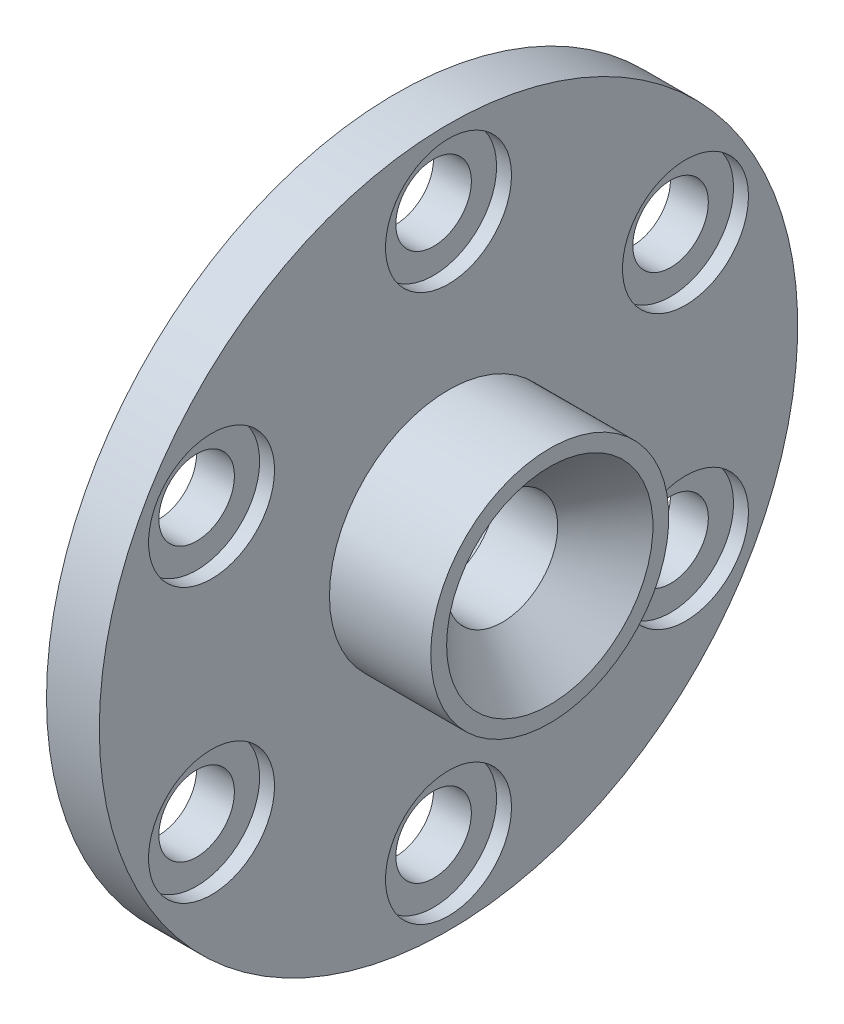
ISO-10303-21;
HEADER;
FILE_DESCRIPTION(('STEP AP214'),'2;1');
FILE_NAME('part.step','',(''),(''),'','','');
FILE_SCHEMA(('AUTOMOTIVE_DESIGN { 1 0 10303 214 1 1 1 1 }'));
ENDSEC;
DATA;
#1=APPLICATION_CONTEXT('core data for automotive mechanical design processes');
#2=APPLICATION_PROTOCOL_DEFINITION('international standard','automotive_design',2000,#1);
#3=PRODUCT_CONTEXT('',#1,'mechanical');
#4=PRODUCT('Part','Part','',(#3));
#5=PRODUCT_RELATED_PRODUCT_CATEGORY('part','',(#4));
#6=PRODUCT_DEFINITION_FORMATION('','',#4);
#7=PRODUCT_DEFINITION_CONTEXT('part definition',#1,'design');
#8=PRODUCT_DEFINITION('design','',#6,#7);
#9=PRODUCT_DEFINITION_SHAPE('','',#8);
#10=(LENGTH_UNIT() NAMED_UNIT(*) SI_UNIT(.MILLI.,.METRE.));
#11=(NAMED_UNIT(*) PLANE_ANGLE_UNIT() SI_UNIT($,.RADIAN.));
#12=(NAMED_UNIT(*) SI_UNIT($,.STERADIAN.) SOLID_ANGLE_UNIT());
#13=UNCERTAINTY_MEASURE_WITH_UNIT(LENGTH_MEASURE(1.E-05),#10,'distance_accuracy_value','');
#14=(GEOMETRIC_REPRESENTATION_CONTEXT(3) GLOBAL_UNCERTAINTY_ASSIGNED_CONTEXT((#13)) GLOBAL_UNIT_ASSIGNED_CONTEXT((#10,
#11,#12)) REPRESENTATION_CONTEXT('',''));
#15=CARTESIAN_POINT('',(0.,0.,0.));
#16=DIRECTION('',(0.,0.,1.));
#17=DIRECTION('',(1.,0.,0.));
#18=AXIS2_PLACEMENT_3D('',#15,#16,#17);
#19=CARTESIAN_POINT('',(23.019799782,8.61924996999999,14.9289788711765));
#20=DIRECTION('',(-1.,0.,0.));
#21=DIRECTION('',(0.,0.,1.));
#22=AXIS2_PLACEMENT_3D('',#19,#20,#21);
#23=CYLINDRICAL_SURFACE('',#22,2.38125);
#24=CARTESIAN_POINT('',(13.312399842,8.61924996999999,14.9289788711765));
#25=DIRECTION('',(1.,0.,0.));
#26=DIRECTION('',(0.,0.,-1.));
#27=AXIS2_PLACEMENT_3D('',#24,#25,#26);
#28=CIRCLE('',#27,2.38125);
#29=CARTESIAN_POINT('',(13.312399842,8.61924996999999,12.5477288711765));
#30=VERTEX_POINT('',#29);
#31=EDGE_CURVE('E69',#30,#30,#28,.F.);
#32=ORIENTED_EDGE('',*,*,#31,.T.);
#33=EDGE_LOOP('',(#32));
#34=FACE_BOUND('',#33,.T.);
#35=CARTESIAN_POINT('',(15.699999842,8.61924996999999,14.9289788711765));
#36=DIRECTION('',(1.,0.,0.));
#37=DIRECTION('',(0.,0.,-1.));
#38=AXIS2_PLACEMENT_3D('',#35,#36,#37);
#39=CIRCLE('',#38,2.38125);
#40=CARTESIAN_POINT('',(15.699999842,8.61924996999999,12.5477288711765));
#41=VERTEX_POINT('',#40);
#42=EDGE_CURVE('E39',#41,#41,#39,.T.);
#43=ORIENTED_EDGE('',*,*,#42,.T.);
#44=EDGE_LOOP('',(#43));
#45=FACE_BOUND('',#44,.T.);
#46=ADVANCED_FACE('F35',(#34,#45),#23,.F.);
#47=CARTESIAN_POINT('',(23.019799782,17.23849994,0.));
#48=DIRECTION('',(-1.,0.,0.));
#49=DIRECTION('',(0.,0.,1.));
#50=AXIS2_PLACEMENT_3D('',#47,#48,#49);
#51=CYLINDRICAL_SURFACE('',#50,2.38125);
#52=CARTESIAN_POINT('',(13.312399842,17.23849994,0.));
#53=DIRECTION('',(1.,0.,0.));
#54=DIRECTION('',(0.,0.,-1.));
#55=AXIS2_PLACEMENT_3D('',#52,#53,#54);
#56=CIRCLE('',#55,2.38125);
#57=CARTESIAN_POINT('',(13.312399842,17.23849994,-2.38125));
#58=VERTEX_POINT('',#57);
#59=EDGE_CURVE('E73',#58,#58,#56,.F.);
#60=ORIENTED_EDGE('',*,*,#59,.T.);
#61=EDGE_LOOP('',(#60));
#62=FACE_BOUND('',#61,.T.);
#63=CARTESIAN_POINT('',(15.699999842,17.23849994,0.));
#64=DIRECTION('',(1.,0.,0.));
#65=DIRECTION('',(0.,0.,-1.));
#66=AXIS2_PLACEMENT_3D('',#63,#64,#65);
#67=CIRCLE('',#66,2.38125);
#68=CARTESIAN_POINT('',(15.699999842,17.23849994,-2.38125));
#69=VERTEX_POINT('',#68);
#70=EDGE_CURVE('E64',#69,#69,#67,.T.);
#71=ORIENTED_EDGE('',*,*,#70,.T.);
#72=EDGE_LOOP('',(#71));
#73=FACE_BOUND('',#72,.T.);
#74=ADVANCED_FACE('F187',(#62,#73),#51,.F.);
#75=CARTESIAN_POINT('',(23.019799782,8.61924997,-14.9289788711765));
#76=DIRECTION('',(-1.,0.,0.));
#77=DIRECTION('',(0.,0.,1.));
#78=AXIS2_PLACEMENT_3D('',#75,#76,#77);
#79=CYLINDRICAL_SURFACE('',#78,2.38125);
#80=CARTESIAN_POINT('',(13.312399842,8.61924997,-14.9289788711765));
#81=DIRECTION('',(1.,0.,0.));
#82=DIRECTION('',(0.,0.,-1.));
#83=AXIS2_PLACEMENT_3D('',#80,#81,#82);
#84=CIRCLE('',#83,2.38125);
#85=CARTESIAN_POINT('',(13.312399842,8.61924997,-17.3102288711765));
#86=VERTEX_POINT('',#85);
#87=EDGE_CURVE('E78',#86,#86,#84,.F.);
#88=ORIENTED_EDGE('',*,*,#87,.T.);
#89=EDGE_LOOP('',(#88));
#90=FACE_BOUND('',#89,.T.);
#91=CARTESIAN_POINT('',(15.699999842,8.61924997,-14.9289788711765));
#92=DIRECTION('',(1.,0.,0.));
#93=DIRECTION('',(0.,0.,-1.));
#94=AXIS2_PLACEMENT_3D('',#91,#92,#93);
#95=CIRCLE('',#94,2.38125);
#96=CARTESIAN_POINT('',(15.699999842,8.61924997,-17.3102288711765));
#97=VERTEX_POINT('',#96);
#98=EDGE_CURVE('E62',#97,#97,#95,.T.);
#99=ORIENTED_EDGE('',*,*,#98,.T.);
#100=EDGE_LOOP('',(#99));
#101=FACE_BOUND('',#100,.T.);
#102=ADVANCED_FACE('F192',(#90,#101),#79,.F.);
#103=CARTESIAN_POINT('',(23.019799782,-8.61924997,-14.9289788711765));
#104=DIRECTION('',(-1.,0.,0.));
#105=DIRECTION('',(0.,0.,1.));
#106=AXIS2_PLACEMENT_3D('',#103,#104,#105);
#107=CYLINDRICAL_SURFACE('',#106,2.38125);
#108=CARTESIAN_POINT('',(13.312399842,-8.61924997,-14.9289788711765));
#109=DIRECTION('',(1.,0.,0.));
#110=DIRECTION('',(0.,0.,-1.));
#111=AXIS2_PLACEMENT_3D('',#108,#109,#110);
#112=CIRCLE('',#111,2.38125);
#113=CARTESIAN_POINT('',(13.312399842,-8.61924997,-17.3102288711765));
#114=VERTEX_POINT('',#113);
#115=EDGE_CURVE('E86',#114,#114,#112,.F.);
#116=ORIENTED_EDGE('',*,*,#115,.T.);
#117=EDGE_LOOP('',(#116));
#118=FACE_BOUND('',#117,.T.);
#119=CARTESIAN_POINT('',(15.699999842,-8.61924997,-14.9289788711765));
#120=DIRECTION('',(1.,0.,0.));
#121=DIRECTION('',(0.,0.,-1.));
#122=AXIS2_PLACEMENT_3D('',#119,#120,#121);
#123=CIRCLE('',#122,2.38125);
#124=CARTESIAN_POINT('',(15.699999842,-8.61924997,-17.3102288711765));
#125=VERTEX_POINT('',#124);
#126=EDGE_CURVE('E59',#125,#125,#123,.T.);
#127=ORIENTED_EDGE('',*,*,#126,.T.);
#128=EDGE_LOOP('',(#127));
#129=FACE_BOUND('',#128,.T.);
#130=ADVANCED_FACE('F307',(#118,#129),#107,.F.);
#131=CARTESIAN_POINT('',(23.019799782,-17.23849994,0.));
#132=DIRECTION('',(-1.,0.,0.));
#133=DIRECTION('',(0.,0.,1.));
#134=AXIS2_PLACEMENT_3D('',#131,#132,#133);
#135=CYLINDRICAL_SURFACE('',#134,2.38125);
#136=CARTESIAN_POINT('',(13.312399842,-17.23849994,0.));
#137=DIRECTION('',(1.,0.,0.));
#138=DIRECTION('',(0.,0.,-1.));
#139=AXIS2_PLACEMENT_3D('',#136,#137,#138);
#140=CIRCLE('',#139,2.38125);
#141=CARTESIAN_POINT('',(13.312399842,-17.23849994,-2.38125));
#142=VERTEX_POINT('',#141);
#143=EDGE_CURVE('E89',#142,#142,#140,.F.);
#144=ORIENTED_EDGE('',*,*,#143,.T.);
#145=EDGE_LOOP('',(#144));
#146=FACE_BOUND('',#145,.T.);
#147=CARTESIAN_POINT('',(15.699999842,-17.23849994,0.));
#148=DIRECTION('',(1.,0.,0.));
#149=DIRECTION('',(0.,0.,-1.));
#150=AXIS2_PLACEMENT_3D('',#147,#148,#149);
#151=CIRCLE('',#150,2.38125);
#152=CARTESIAN_POINT('',(15.699999842,-17.23849994,-2.38125));
#153=VERTEX_POINT('',#152);
#154=EDGE_CURVE('E55',#153,#153,#151,.T.);
#155=ORIENTED_EDGE('',*,*,#154,.T.);
#156=EDGE_LOOP('',(#155));
#157=FACE_BOUND('',#156,.T.);
#158=ADVANCED_FACE('F181',(#146,#157),#135,.F.);
#159=CARTESIAN_POINT('',(23.019799782,-8.61924997000001,14.9289788711765));
#160=DIRECTION('',(-1.,0.,0.));
#161=DIRECTION('',(0.,0.,1.));
#162=AXIS2_PLACEMENT_3D('',#159,#160,#161);
#163=CYLINDRICAL_SURFACE('',#162,2.38125);
#164=CARTESIAN_POINT('',(13.312399842,-8.61924997000001,14.9289788711765));
#165=DIRECTION('',(1.,0.,0.));
#166=DIRECTION('',(0.,0.,-1.));
#167=AXIS2_PLACEMENT_3D('',#164,#165,#166);
#168=CIRCLE('',#167,2.38125);
#169=CARTESIAN_POINT('',(13.312399842,-8.61924997000001,12.5477288711765));
#170=VERTEX_POINT('',#169);
#171=EDGE_CURVE('E92',#170,#170,#168,.F.);
#172=ORIENTED_EDGE('',*,*,#171,.T.);
#173=EDGE_LOOP('',(#172));
#174=FACE_BOUND('',#173,.T.);
#175=CARTESIAN_POINT('',(15.699999842,-8.61924997000001,14.9289788711765));
#176=DIRECTION('',(1.,0.,0.));
#177=DIRECTION('',(0.,0.,-1.));
#178=AXIS2_PLACEMENT_3D('',#175,#176,#177);
#179=CIRCLE('',#178,2.38125);
#180=CARTESIAN_POINT('',(15.699999842,-8.61924997000001,12.5477288711765));
#181=VERTEX_POINT('',#180);
#182=EDGE_CURVE('E52',#181,#181,#179,.T.);
#183=ORIENTED_EDGE('',*,*,#182,.T.);
#184=EDGE_LOOP('',(#183));
#185=FACE_BOUND('',#184,.T.);
#186=ADVANCED_FACE('F174',(#174,#185),#163,.F.);
#187=CARTESIAN_POINT('',(13.312399842,12.269749908,0.));
#188=DIRECTION('',(1.,0.,0.));
#189=DIRECTION('',(0.,0.,-1.));
#190=AXIS2_PLACEMENT_3D('',#187,#188,#189);
#191=PLANE('',#190);
#192=ORIENTED_EDGE('',*,*,#171,.F.);
#193=EDGE_LOOP('',(#192));
#194=FACE_BOUND('',#193,.T.);
#195=ORIENTED_EDGE('',*,*,#143,.F.);
#196=EDGE_LOOP('',(#195));
#197=FACE_BOUND('',#196,.T.);
#198=ORIENTED_EDGE('',*,*,#115,.F.);
#199=EDGE_LOOP('',(#198));
#200=FACE_BOUND('',#199,.T.);
#201=ORIENTED_EDGE('',*,*,#87,.F.);
#202=EDGE_LOOP('',(#201));
#203=FACE_BOUND('',#202,.T.);
#204=ORIENTED_EDGE('',*,*,#59,.F.);
#205=EDGE_LOOP('',(#204));
#206=FACE_BOUND('',#205,.T.);
#207=ORIENTED_EDGE('',*,*,#31,.F.);
#208=EDGE_LOOP('',(#207));
#209=FACE_BOUND('',#208,.T.);
#210=CARTESIAN_POINT('',(13.312399842,0.,0.));
#211=DIRECTION('',(-1.,0.,0.));
#212=DIRECTION('',(0.,0.,1.));
#213=AXIS2_PLACEMENT_3D('',#210,#211,#212);
#214=CIRCLE('',#213,12.269749908);
#215=CARTESIAN_POINT('',(13.312399842,0.,12.269749908));
#216=VERTEX_POINT('',#215);
#217=EDGE_CURVE('E95',#216,#216,#214,.T.);
#218=ORIENTED_EDGE('',*,*,#217,.F.);
#219=EDGE_LOOP('',(#218));
#220=FACE_BOUND('',#219,.T.);
#221=CARTESIAN_POINT('',(13.312399842,0.,0.));
#222=DIRECTION('',(-1.,0.,0.));
#223=DIRECTION('',(0.,0.,1.));
#224=AXIS2_PLACEMENT_3D('',#221,#222,#223);
#225=CIRCLE('',#224,22.00099994);
#226=CARTESIAN_POINT('',(13.312399842,0.,22.00099994));
#227=VERTEX_POINT('',#226);
#228=EDGE_CURVE('E10',#227,#227,#225,.T.);
#229=ORIENTED_EDGE('',*,*,#228,.T.);
#230=EDGE_LOOP('',(#229));
#231=FACE_BOUND('',#230,.T.);
#232=ADVANCED_FACE('F37',(#194,#197,#200,#203,#206,#209,#220,#231),#191,.F.);
#233=CARTESIAN_POINT('',(0.,0.,0.));
#234=DIRECTION('',(-1.,0.,0.));
#235=DIRECTION('',(0.,0.,1.));
#236=AXIS2_PLACEMENT_3D('',#233,#234,#235);
#237=CYLINDRICAL_SURFACE('',#236,22.00099994);
#238=ORIENTED_EDGE('',*,*,#228,.F.);
#239=EDGE_LOOP('',(#238));
#240=FACE_BOUND('',#239,.T.);
#241=CARTESIAN_POINT('',(16.639799842,0.,0.));
#242=DIRECTION('',(-1.,0.,0.));
#243=DIRECTION('',(0.,0.,1.));
#244=AXIS2_PLACEMENT_3D('',#241,#242,#243);
#245=CIRCLE('',#244,22.00099994);
#246=CARTESIAN_POINT('',(16.639799842,0.,22.00099994));
#247=VERTEX_POINT('',#246);
#248=EDGE_CURVE('E43',#247,#247,#245,.T.);
#249=ORIENTED_EDGE('',*,*,#248,.T.);
#250=EDGE_LOOP('',(#249));
#251=FACE_BOUND('',#250,.T.);
#252=ADVANCED_FACE('F173',(#240,#251),#237,.T.);
#253=CARTESIAN_POINT('',(16.639799842,22.00099994,0.));
#254=DIRECTION('',(-1.,0.,0.));
#255=DIRECTION('',(0.,0.,1.));
#256=AXIS2_PLACEMENT_3D('',#253,#254,#255);
#257=PLANE('',#256);
#258=CARTESIAN_POINT('',(16.639799842,17.23849994,0.));
#259=DIRECTION('',(1.,0.,0.));
#260=DIRECTION('',(0.,0.,-1.));
#261=AXIS2_PLACEMENT_3D('',#258,#259,#260);
#262=CIRCLE('',#261,3.96875);
#263=CARTESIAN_POINT('',(16.639799842,17.23849994,-3.96875));
#264=VERTEX_POINT('',#263);
#265=EDGE_CURVE('E204',#264,#264,#262,.T.);
#266=ORIENTED_EDGE('',*,*,#265,.F.);
#267=EDGE_LOOP('',(#266));
#268=FACE_BOUND('',#267,.T.);
#269=CARTESIAN_POINT('',(16.639799842,8.61924996999999,14.9289788711765));
#270=DIRECTION('',(1.,0.,0.));
#271=DIRECTION('',(0.,0.,-1.));
#272=AXIS2_PLACEMENT_3D('',#269,#270,#271);
#273=CIRCLE('',#272,3.96875);
#274=CARTESIAN_POINT('',(16.639799842,8.61924996999999,10.9602288711765));
#275=VERTEX_POINT('',#274);
#276=EDGE_CURVE('E208',#275,#275,#273,.T.);
#277=ORIENTED_EDGE('',*,*,#276,.F.);
#278=EDGE_LOOP('',(#277));
#279=FACE_BOUND('',#278,.T.);
#280=CARTESIAN_POINT('',(16.639799842,-8.61924997000001,14.9289788711765));
#281=DIRECTION('',(1.,0.,0.));
#282=DIRECTION('',(0.,0.,-1.));
#283=AXIS2_PLACEMENT_3D('',#280,#281,#282);
#284=CIRCLE('',#283,3.96875);
#285=CARTESIAN_POINT('',(16.639799842,-8.61924997000001,10.9602288711765));
#286=VERTEX_POINT('',#285);
#287=EDGE_CURVE('E212',#286,#286,#284,.T.);
#288=ORIENTED_EDGE('',*,*,#287,.F.);
#289=EDGE_LOOP('',(#288));
#290=FACE_BOUND('',#289,.T.);
#291=CARTESIAN_POINT('',(16.639799842,-17.23849994,0.));
#292=DIRECTION('',(1.,0.,0.));
#293=DIRECTION('',(0.,0.,-1.));
#294=AXIS2_PLACEMENT_3D('',#291,#292,#293);
#295=CIRCLE('',#294,3.96875);
#296=CARTESIAN_POINT('',(16.639799842,-17.23849994,-3.96875));
#297=VERTEX_POINT('',#296);
#298=EDGE_CURVE('E216',#297,#297,#295,.T.);
#299=ORIENTED_EDGE('',*,*,#298,.F.);
#300=EDGE_LOOP('',(#299));
#301=FACE_BOUND('',#300,.T.);
#302=CARTESIAN_POINT('',(16.639799842,-8.61924997,-14.9289788711765));
#303=DIRECTION('',(1.,0.,0.));
#304=DIRECTION('',(0.,0.,-1.));
#305=AXIS2_PLACEMENT_3D('',#302,#303,#304);
#306=CIRCLE('',#305,3.96875);
#307=CARTESIAN_POINT('',(16.639799842,-8.61924997,-18.8977288711765));
#308=VERTEX_POINT('',#307);
#309=EDGE_CURVE('E220',#308,#308,#306,.T.);
#310=ORIENTED_EDGE('',*,*,#309,.F.);
#311=EDGE_LOOP('',(#310));
#312=FACE_BOUND('',#311,.T.);
#313=CARTESIAN_POINT('',(16.639799842,8.61924997,-14.9289788711765));
#314=DIRECTION('',(1.,0.,0.));
#315=DIRECTION('',(0.,0.,-1.));
#316=AXIS2_PLACEMENT_3D('',#313,#314,#315);
#317=CIRCLE('',#316,3.96875);
#318=CARTESIAN_POINT('',(16.639799842,8.61924997,-18.8977288711765));
#319=VERTEX_POINT('',#318);
#320=EDGE_CURVE('E224',#319,#319,#317,.T.);
#321=ORIENTED_EDGE('',*,*,#320,.F.);
#322=EDGE_LOOP('',(#321));
#323=FACE_BOUND('',#322,.T.);
#324=ORIENTED_EDGE('',*,*,#248,.F.);
#325=EDGE_LOOP('',(#324));
#326=FACE_BOUND('',#325,.T.);
#327=CARTESIAN_POINT('',(16.639799842,0.,0.));
#328=DIRECTION('',(-1.,0.,0.));
#329=DIRECTION('',(0.,0.,1.));
#330=AXIS2_PLACEMENT_3D('',#327,#328,#329);
#331=CIRCLE('',#330,7.499999986);
#332=CARTESIAN_POINT('',(16.639799842,0.,7.499999986));
#333=VERTEX_POINT('',#332);
#334=EDGE_CURVE('E48',#333,#333,#331,.T.);
#335=ORIENTED_EDGE('',*,*,#334,.T.);
#336=EDGE_LOOP('',(#335));
#337=FACE_BOUND('',#336,.T.);
#338=ADVANCED_FACE('F121',(#268,#279,#290,#301,#312,#323,#326,#337),#257,.F.);
#339=CARTESIAN_POINT('',(0.,0.,0.));
#340=DIRECTION('',(-1.,0.,0.));
#341=DIRECTION('',(0.,0.,1.));
#342=AXIS2_PLACEMENT_3D('',#339,#340,#341);
#343=CYLINDRICAL_SURFACE('',#342,7.499999986);
#344=ORIENTED_EDGE('',*,*,#334,.F.);
#345=EDGE_LOOP('',(#344));
#346=FACE_BOUND('',#345,.T.);
#347=CARTESIAN_POINT('',(23.019799782,0.,0.));
#348=DIRECTION('',(-1.,0.,0.));
#349=DIRECTION('',(0.,0.,1.));
#350=AXIS2_PLACEMENT_3D('',#347,#348,#349);
#351=CIRCLE('',#350,7.499999986);
#352=CARTESIAN_POINT('',(23.019799782,0.,7.499999986));
#353=VERTEX_POINT('',#352);
#354=EDGE_CURVE('E116',#353,#353,#351,.T.);
#355=ORIENTED_EDGE('',*,*,#354,.T.);
#356=EDGE_LOOP('',(#355));
#357=FACE_BOUND('',#356,.T.);
#358=ADVANCED_FACE('F123',(#346,#357),#343,.T.);
#359=CARTESIAN_POINT('',(23.019799782,7.499999986,0.));
#360=DIRECTION('',(-1.,0.,0.));
#361=DIRECTION('',(0.,0.,1.));
#362=AXIS2_PLACEMENT_3D('',#359,#360,#361);
#363=PLANE('',#362);
#364=ORIENTED_EDGE('',*,*,#354,.F.);
#365=EDGE_LOOP('',(#364));
#366=FACE_BOUND('',#365,.T.);
#367=CARTESIAN_POINT('',(23.019799782,0.,0.));
#368=DIRECTION('',(-1.,0.,0.));
#369=DIRECTION('',(0.,0.,1.));
#370=AXIS2_PLACEMENT_3D('',#367,#368,#369);
#371=CIRCLE('',#370,6.499999954);
#372=CARTESIAN_POINT('',(23.019799782,0.,6.499999954));
#373=VERTEX_POINT('',#372);
#374=EDGE_CURVE('E113',#373,#373,#371,.T.);
#375=ORIENTED_EDGE('',*,*,#374,.T.);
#376=EDGE_LOOP('',(#375));
#377=FACE_BOUND('',#376,.T.);
#378=ADVANCED_FACE('F126',(#366,#377),#363,.F.);
#379=CARTESIAN_POINT('',(20.019799813,0.,0.));
#380=DIRECTION('',(1.,0.,0.));
#381=DIRECTION('',(0.,0.,-1.));
#382=AXIS2_PLACEMENT_3D('',#379,#380,#381);
#383=CONICAL_SURFACE('',#382,3.499999985,0.785398163397442);
#384=ORIENTED_EDGE('',*,*,#374,.F.);
#385=EDGE_LOOP('',(#384));
#386=FACE_BOUND('',#385,.T.);
#387=CARTESIAN_POINT('',(20.019799813,0.,0.));
#388=DIRECTION('',(-1.,0.,0.));
#389=DIRECTION('',(0.,0.,1.));
#390=AXIS2_PLACEMENT_3D('',#387,#388,#389);
#391=CIRCLE('',#390,3.499999985);
#392=CARTESIAN_POINT('',(20.019799813,0.,3.499999985));
#393=VERTEX_POINT('',#392);
#394=EDGE_CURVE('E110',#393,#393,#391,.T.);
#395=ORIENTED_EDGE('',*,*,#394,.T.);
#396=EDGE_LOOP('',(#395));
#397=FACE_BOUND('',#396,.T.);
#398=ADVANCED_FACE('F132',(#386,#397),#383,.F.);
#399=CARTESIAN_POINT('',(0.,0.,0.));
#400=DIRECTION('',(-1.,0.,0.));
#401=DIRECTION('',(0.,0.,1.));
#402=AXIS2_PLACEMENT_3D('',#399,#400,#401);
#403=CYLINDRICAL_SURFACE('',#402,3.499999985);
#404=ORIENTED_EDGE('',*,*,#394,.F.);
#405=EDGE_LOOP('',(#404));
#406=FACE_BOUND('',#405,.T.);
#407=CARTESIAN_POINT('',(16.119799866,0.,0.));
#408=DIRECTION('',(-1.,0.,0.));
#409=DIRECTION('',(0.,0.,1.));
#410=AXIS2_PLACEMENT_3D('',#407,#408,#409);
#411=CIRCLE('',#410,3.499999985);
#412=CARTESIAN_POINT('',(16.119799866,0.,3.499999985));
#413=VERTEX_POINT('',#412);
#414=EDGE_CURVE('E107',#413,#413,#411,.T.);
#415=ORIENTED_EDGE('',*,*,#414,.T.);
#416=EDGE_LOOP('',(#415));
#417=FACE_BOUND('',#416,.T.);
#418=ADVANCED_FACE('F138',(#406,#417),#403,.F.);
#419=CARTESIAN_POINT('',(16.119799866,3.499999985,0.));
#420=DIRECTION('',(1.,0.,0.));
#421=DIRECTION('',(0.,0.,-1.));
#422=AXIS2_PLACEMENT_3D('',#419,#420,#421);
#423=PLANE('',#422);
#424=ORIENTED_EDGE('',*,*,#414,.F.);
#425=EDGE_LOOP('',(#424));
#426=FACE_BOUND('',#425,.T.);
#427=CARTESIAN_POINT('',(16.119799866,0.,0.));
#428=DIRECTION('',(-1.,0.,0.));
#429=DIRECTION('',(0.,0.,1.));
#430=AXIS2_PLACEMENT_3D('',#427,#428,#429);
#431=CIRCLE('',#430,4.000000001);
#432=CARTESIAN_POINT('',(16.119799866,0.,4.000000001));
#433=VERTEX_POINT('',#432);
#434=EDGE_CURVE('E104',#433,#433,#431,.T.);
#435=ORIENTED_EDGE('',*,*,#434,.T.);
#436=EDGE_LOOP('',(#435));
#437=FACE_BOUND('',#436,.T.);
#438=ADVANCED_FACE('F144',(#426,#437),#423,.F.);
#439=CARTESIAN_POINT('',(0.,0.,0.));
#440=DIRECTION('',(-1.,0.,0.));
#441=DIRECTION('',(0.,0.,1.));
#442=AXIS2_PLACEMENT_3D('',#439,#440,#441);
#443=CYLINDRICAL_SURFACE('',#442,4.000000001);
#444=ORIENTED_EDGE('',*,*,#434,.F.);
#445=EDGE_LOOP('',(#444));
#446=FACE_BOUND('',#445,.T.);
#447=CARTESIAN_POINT('',(13.639799746,0.,0.));
#448=DIRECTION('',(-1.,0.,0.));
#449=DIRECTION('',(0.,0.,1.));
#450=AXIS2_PLACEMENT_3D('',#447,#448,#449);
#451=CIRCLE('',#450,4.000000001);
#452=CARTESIAN_POINT('',(13.639799746,0.,4.000000001));
#453=VERTEX_POINT('',#452);
#454=EDGE_CURVE('E101',#453,#453,#451,.T.);
#455=ORIENTED_EDGE('',*,*,#454,.T.);
#456=EDGE_LOOP('',(#455));
#457=FACE_BOUND('',#456,.T.);
#458=ADVANCED_FACE('F150',(#446,#457),#443,.F.);
#459=CARTESIAN_POINT('',(13.639799746,4.000000001,0.));
#460=DIRECTION('',(1.,0.,0.));
#461=DIRECTION('',(0.,0.,-1.));
#462=AXIS2_PLACEMENT_3D('',#459,#460,#461);
#463=PLANE('',#462);
#464=ORIENTED_EDGE('',*,*,#454,.F.);
#465=EDGE_LOOP('',(#464));
#466=FACE_BOUND('',#465,.T.);
#467=CARTESIAN_POINT('',(13.639799746,0.,0.));
#468=DIRECTION('',(-1.,0.,0.));
#469=DIRECTION('',(0.,0.,1.));
#470=AXIS2_PLACEMENT_3D('',#467,#468,#469);
#471=CIRCLE('',#470,12.269749908);
#472=CARTESIAN_POINT('',(13.639799746,0.,12.269749908));
#473=VERTEX_POINT('',#472);
#474=EDGE_CURVE('E98',#473,#473,#471,.T.);
#475=ORIENTED_EDGE('',*,*,#474,.T.);
#476=EDGE_LOOP('',(#475));
#477=FACE_BOUND('',#476,.T.);
#478=ADVANCED_FACE('F156',(#466,#477),#463,.F.);
#479=CARTESIAN_POINT('',(0.,0.,0.));
#480=DIRECTION('',(-1.,0.,0.));
#481=DIRECTION('',(0.,0.,1.));
#482=AXIS2_PLACEMENT_3D('',#479,#480,#481);
#483=CYLINDRICAL_SURFACE('',#482,12.269749908);
#484=ORIENTED_EDGE('',*,*,#474,.F.);
#485=EDGE_LOOP('',(#484));
#486=FACE_BOUND('',#485,.T.);
#487=ORIENTED_EDGE('',*,*,#217,.T.);
#488=EDGE_LOOP('',(#487));
#489=FACE_BOUND('',#488,.T.);
#490=ADVANCED_FACE('F162',(#486,#489),#483,.F.);
#491=CARTESIAN_POINT('',(15.699999842,-8.61924997000001,14.9289788711765));
#492=DIRECTION('',(1.,0.,0.));
#493=DIRECTION('',(0.,0.,-1.));
#494=AXIS2_PLACEMENT_3D('',#491,#492,#493);
#495=CYLINDRICAL_SURFACE('',#494,3.96875);
#496=CARTESIAN_POINT('',(15.699999842,-8.61924997000001,14.9289788711765));
#497=DIRECTION('',(1.,0.,0.));
#498=DIRECTION('',(0.,0.,-1.));
#499=AXIS2_PLACEMENT_3D('',#496,#497,#498);
#500=CIRCLE('',#499,3.96875);
#501=CARTESIAN_POINT('',(15.699999842,-8.61924997000001,10.9602288711765));
#502=VERTEX_POINT('',#501);
#503=EDGE_CURVE('E81',#502,#502,#500,.T.);
#504=ORIENTED_EDGE('',*,*,#503,.F.);
#505=EDGE_LOOP('',(#504));
#506=FACE_BOUND('',#505,.T.);
#507=ORIENTED_EDGE('',*,*,#287,.T.);
#508=EDGE_LOOP('',(#507));
#509=FACE_BOUND('',#508,.T.);
#510=ADVANCED_FACE('F168',(#506,#509),#495,.F.);
#511=CARTESIAN_POINT('',(15.699999842,-8.61924997000001,14.9289788711765));
#512=DIRECTION('',(1.,0.,0.));
#513=DIRECTION('',(0.,0.,-1.));
#514=AXIS2_PLACEMENT_3D('',#511,#512,#513);
#515=PLANE('',#514);
#516=ORIENTED_EDGE('',*,*,#182,.F.);
#517=EDGE_LOOP('',(#516));
#518=FACE_BOUND('',#517,.T.);
#519=ORIENTED_EDGE('',*,*,#503,.T.);
#520=EDGE_LOOP('',(#519));
#521=FACE_BOUND('',#520,.T.);
#522=ADVANCED_FACE('F294',(#518,#521),#515,.T.);
#523=CARTESIAN_POINT('',(15.699999842,-17.23849994,0.));
#524=DIRECTION('',(1.,0.,0.));
#525=DIRECTION('',(0.,0.,-1.));
#526=AXIS2_PLACEMENT_3D('',#523,#524,#525);
#527=CYLINDRICAL_SURFACE('',#526,3.96875);
#528=CARTESIAN_POINT('',(15.699999842,-17.23849994,0.));
#529=DIRECTION('',(1.,0.,0.));
#530=DIRECTION('',(0.,0.,-1.));
#531=AXIS2_PLACEMENT_3D('',#528,#529,#530);
#532=CIRCLE('',#531,3.96875);
#533=CARTESIAN_POINT('',(15.699999842,-17.23849994,-3.96875));
#534=VERTEX_POINT('',#533);
#535=EDGE_CURVE('E242',#534,#534,#532,.T.);
#536=ORIENTED_EDGE('',*,*,#535,.F.);
#537=EDGE_LOOP('',(#536));
#538=FACE_BOUND('',#537,.T.);
#539=ORIENTED_EDGE('',*,*,#298,.T.);
#540=EDGE_LOOP('',(#539));
#541=FACE_BOUND('',#540,.T.);
#542=ADVANCED_FACE('F291',(#538,#541),#527,.F.);
#543=CARTESIAN_POINT('',(15.699999842,-17.23849994,0.));
#544=DIRECTION('',(1.,0.,0.));
#545=DIRECTION('',(0.,0.,-1.));
#546=AXIS2_PLACEMENT_3D('',#543,#544,#545);
#547=PLANE('',#546);
#548=ORIENTED_EDGE('',*,*,#154,.F.);
#549=EDGE_LOOP('',(#548));
#550=FACE_BOUND('',#549,.T.);
#551=ORIENTED_EDGE('',*,*,#535,.T.);
#552=EDGE_LOOP('',(#551));
#553=FACE_BOUND('',#552,.T.);
#554=ADVANCED_FACE('F286',(#550,#553),#547,.T.);
#555=CARTESIAN_POINT('',(15.699999842,-8.61924997,-14.9289788711765));
#556=DIRECTION('',(1.,0.,0.));
#557=DIRECTION('',(0.,0.,-1.));
#558=AXIS2_PLACEMENT_3D('',#555,#556,#557);
#559=CYLINDRICAL_SURFACE('',#558,3.96875);
#560=CARTESIAN_POINT('',(15.699999842,-8.61924997,-14.9289788711765));
#561=DIRECTION('',(1.,0.,0.));
#562=DIRECTION('',(0.,0.,-1.));
#563=AXIS2_PLACEMENT_3D('',#560,#561,#562);
#564=CIRCLE('',#563,3.96875);
#565=CARTESIAN_POINT('',(15.699999842,-8.61924997,-18.8977288711765));
#566=VERTEX_POINT('',#565);
#567=EDGE_CURVE('E238',#566,#566,#564,.T.);
#568=ORIENTED_EDGE('',*,*,#567,.F.);
#569=EDGE_LOOP('',(#568));
#570=FACE_BOUND('',#569,.T.);
#571=ORIENTED_EDGE('',*,*,#309,.T.);
#572=EDGE_LOOP('',(#571));
#573=FACE_BOUND('',#572,.T.);
#574=ADVANCED_FACE('F283',(#570,#573),#559,.F.);
#575=CARTESIAN_POINT('',(15.699999842,-8.61924997,-14.9289788711765));
#576=DIRECTION('',(1.,0.,0.));
#577=DIRECTION('',(0.,0.,-1.));
#578=AXIS2_PLACEMENT_3D('',#575,#576,#577);
#579=PLANE('',#578);
#580=ORIENTED_EDGE('',*,*,#126,.F.);
#581=EDGE_LOOP('',(#580));
#582=FACE_BOUND('',#581,.T.);
#583=ORIENTED_EDGE('',*,*,#567,.T.);
#584=EDGE_LOOP('',(#583));
#585=FACE_BOUND('',#584,.T.);
#586=ADVANCED_FACE('F280',(#582,#585),#579,.T.);
#587=CARTESIAN_POINT('',(15.699999842,8.61924997,-14.9289788711765));
#588=DIRECTION('',(1.,0.,0.));
#589=DIRECTION('',(0.,0.,-1.));
#590=AXIS2_PLACEMENT_3D('',#587,#588,#589);
#591=CYLINDRICAL_SURFACE('',#590,3.96875);
#592=CARTESIAN_POINT('',(15.699999842,8.61924997,-14.9289788711765));
#593=DIRECTION('',(1.,0.,0.));
#594=DIRECTION('',(0.,0.,-1.));
#595=AXIS2_PLACEMENT_3D('',#592,#593,#594);
#596=CIRCLE('',#595,3.96875);
#597=CARTESIAN_POINT('',(15.699999842,8.61924997,-18.8977288711765));
#598=VERTEX_POINT('',#597);
#599=EDGE_CURVE('E228',#598,#598,#596,.T.);
#600=ORIENTED_EDGE('',*,*,#599,.F.);
#601=EDGE_LOOP('',(#600));
#602=FACE_BOUND('',#601,.T.);
#603=ORIENTED_EDGE('',*,*,#320,.T.);
#604=EDGE_LOOP('',(#603));
#605=FACE_BOUND('',#604,.T.);
#606=ADVANCED_FACE('F268',(#602,#605),#591,.F.);
#607=CARTESIAN_POINT('',(15.699999842,8.61924997,-14.9289788711765));
#608=DIRECTION('',(1.,0.,0.));
#609=DIRECTION('',(0.,0.,-1.));
#610=AXIS2_PLACEMENT_3D('',#607,#608,#609);
#611=PLANE('',#610);
#612=ORIENTED_EDGE('',*,*,#98,.F.);
#613=EDGE_LOOP('',(#612));
#614=FACE_BOUND('',#613,.T.);
#615=ORIENTED_EDGE('',*,*,#599,.T.);
#616=EDGE_LOOP('',(#615));
#617=FACE_BOUND('',#616,.T.);
#618=ADVANCED_FACE('F259',(#614,#617),#611,.T.);
#619=CARTESIAN_POINT('',(15.699999842,17.23849994,0.));
#620=DIRECTION('',(1.,0.,0.));
#621=DIRECTION('',(0.,0.,-1.));
#622=AXIS2_PLACEMENT_3D('',#619,#620,#621);
#623=CYLINDRICAL_SURFACE('',#622,3.96875);
#624=CARTESIAN_POINT('',(15.699999842,17.23849994,0.));
#625=DIRECTION('',(1.,0.,0.));
#626=DIRECTION('',(0.,0.,-1.));
#627=AXIS2_PLACEMENT_3D('',#624,#625,#626);
#628=CIRCLE('',#627,3.96875);
#629=CARTESIAN_POINT('',(15.699999842,17.23849994,-3.96875));
#630=VERTEX_POINT('',#629);
#631=EDGE_CURVE('E56',#630,#630,#628,.T.);
#632=ORIENTED_EDGE('',*,*,#631,.F.);
#633=EDGE_LOOP('',(#632));
#634=FACE_BOUND('',#633,.T.);
#635=ORIENTED_EDGE('',*,*,#265,.T.);
#636=EDGE_LOOP('',(#635));
#637=FACE_BOUND('',#636,.T.);
#638=ADVANCED_FACE('F256',(#634,#637),#623,.F.);
#639=CARTESIAN_POINT('',(15.699999842,17.23849994,0.));
#640=DIRECTION('',(1.,0.,0.));
#641=DIRECTION('',(0.,0.,-1.));
#642=AXIS2_PLACEMENT_3D('',#639,#640,#641);
#643=PLANE('',#642);
#644=ORIENTED_EDGE('',*,*,#70,.F.);
#645=EDGE_LOOP('',(#644));
#646=FACE_BOUND('',#645,.T.);
#647=ORIENTED_EDGE('',*,*,#631,.T.);
#648=EDGE_LOOP('',(#647));
#649=FACE_BOUND('',#648,.T.);
#650=ADVANCED_FACE('F254',(#646,#649),#643,.T.);
#651=CARTESIAN_POINT('',(15.699999842,8.61924996999999,14.9289788711765));
#652=DIRECTION('',(1.,0.,0.));
#653=DIRECTION('',(0.,0.,-1.));
#654=AXIS2_PLACEMENT_3D('',#651,#652,#653);
#655=CYLINDRICAL_SURFACE('',#654,3.96875);
#656=CARTESIAN_POINT('',(15.699999842,8.61924996999999,14.9289788711765));
#657=DIRECTION('',(1.,0.,0.));
#658=DIRECTION('',(0.,0.,-1.));
#659=AXIS2_PLACEMENT_3D('',#656,#657,#658);
#660=CIRCLE('',#659,3.96875);
#661=CARTESIAN_POINT('',(15.699999842,8.61924996999999,10.9602288711765));
#662=VERTEX_POINT('',#661);
#663=EDGE_CURVE('E234',#662,#662,#660,.T.);
#664=ORIENTED_EDGE('',*,*,#663,.F.);
#665=EDGE_LOOP('',(#664));
#666=FACE_BOUND('',#665,.T.);
#667=ORIENTED_EDGE('',*,*,#276,.T.);
#668=EDGE_LOOP('',(#667));
#669=FACE_BOUND('',#668,.T.);
#670=ADVANCED_FACE('F265',(#666,#669),#655,.F.);
#671=CARTESIAN_POINT('',(15.699999842,8.61924996999999,14.9289788711765));
#672=DIRECTION('',(1.,0.,0.));
#673=DIRECTION('',(0.,0.,-1.));
#674=AXIS2_PLACEMENT_3D('',#671,#672,#673);
#675=PLANE('',#674);
#676=ORIENTED_EDGE('',*,*,#42,.F.);
#677=EDGE_LOOP('',(#676));
#678=FACE_BOUND('',#677,.T.);
#679=ORIENTED_EDGE('',*,*,#663,.T.);
#680=EDGE_LOOP('',(#679));
#681=FACE_BOUND('',#680,.T.);
#682=ADVANCED_FACE('F274',(#678,#681),#675,.T.);
#683=CLOSED_SHELL('',(#46,#74,#102,#130,#158,#186,#232,#252,#338,#358,#378,#398,#418,#438,#458,
#478,#490,#510,#522,#542,#554,#574,#586,#606,#618,#638,#650,#670,#682));
#684=MANIFOLD_SOLID_BREP('B2',#683);
#685=ADVANCED_BREP_SHAPE_REPRESENTATION('',(#18,#684),#14);
#686=SHAPE_DEFINITION_REPRESENTATION(#9,#685);
ENDSEC;
END-ISO-10303-21;
